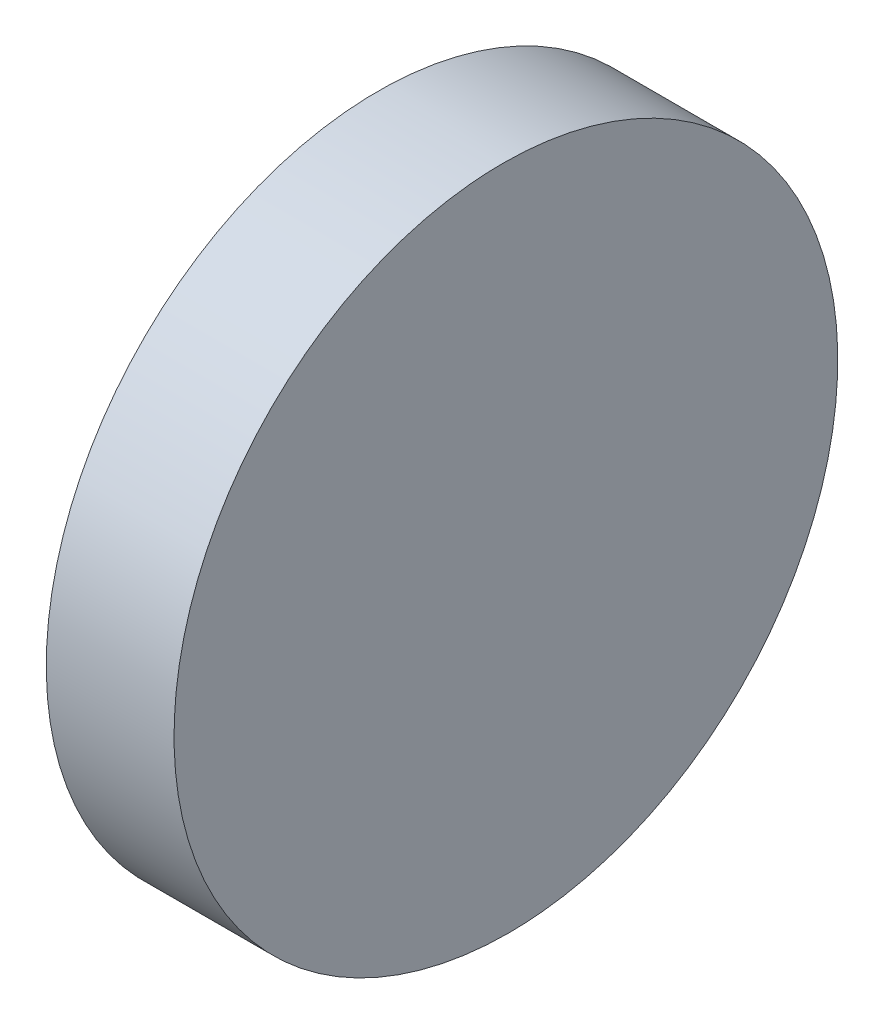
ISO-10303-21;
HEADER;
FILE_DESCRIPTION(('STEP AP214'),'2;1');
FILE_NAME('part.step','',(''),(''),'','','');
FILE_SCHEMA(('AUTOMOTIVE_DESIGN { 1 0 10303 214 1 1 1 1 }'));
ENDSEC;
DATA;
#1=APPLICATION_CONTEXT('core data for automotive mechanical design processes');
#2=APPLICATION_PROTOCOL_DEFINITION('international standard','automotive_design',2000,#1);
#3=PRODUCT_CONTEXT('',#1,'mechanical');
#4=PRODUCT('Part','Part','',(#3));
#5=PRODUCT_RELATED_PRODUCT_CATEGORY('part','',(#4));
#6=PRODUCT_DEFINITION_FORMATION('','',#4);
#7=PRODUCT_DEFINITION_CONTEXT('part definition',#1,'design');
#8=PRODUCT_DEFINITION('design','',#6,#7);
#9=PRODUCT_DEFINITION_SHAPE('','',#8);
#10=(LENGTH_UNIT() NAMED_UNIT(*) SI_UNIT(.MILLI.,.METRE.));
#11=(NAMED_UNIT(*) PLANE_ANGLE_UNIT() SI_UNIT($,.RADIAN.));
#12=(NAMED_UNIT(*) SI_UNIT($,.STERADIAN.) SOLID_ANGLE_UNIT());
#13=UNCERTAINTY_MEASURE_WITH_UNIT(LENGTH_MEASURE(1.E-05),#10,'distance_accuracy_value','');
#14=(GEOMETRIC_REPRESENTATION_CONTEXT(3) GLOBAL_UNCERTAINTY_ASSIGNED_CONTEXT((#13)) GLOBAL_UNIT_ASSIGNED_CONTEXT((#10,
#11,#12)) REPRESENTATION_CONTEXT('',''));
#15=CARTESIAN_POINT('',(0.,0.,0.));
#16=DIRECTION('',(0.,0.,1.));
#17=DIRECTION('',(1.,0.,0.));
#18=AXIS2_PLACEMENT_3D('',#15,#16,#17);
#19=CARTESIAN_POINT('',(0.,25.4,50.8));
#20=DIRECTION('',(1.,0.,0.));
#21=DIRECTION('',(0.,1.,0.));
#22=AXIS2_PLACEMENT_3D('',#19,#20,#21);
#23=PLANE('',#22);
#24=CARTESIAN_POINT('',(0.,0.,25.4));
#25=DIRECTION('',(-1.,0.,0.));
#26=DIRECTION('',(0.,-1.,0.));
#27=AXIS2_PLACEMENT_3D('',#24,#25,#26);
#28=CIRCLE('',#27,25.4);
#29=CARTESIAN_POINT('',(0.,-25.4,25.4));
#30=VERTEX_POINT('',#29);
#31=EDGE_CURVE('E117',#30,#30,#28,.T.);
#32=ORIENTED_EDGE('',*,*,#31,.T.);
#33=EDGE_LOOP('',(#32));
#34=FACE_BOUND('',#33,.T.);
#35=ADVANCED_FACE('F109',(#34),#23,.F.);
#36=CARTESIAN_POINT('',(10.,-25.4,50.8));
#37=DIRECTION('',(-0.999961923064172,-0.00872653549836697,0.));
#38=DIRECTION('',(0.00872653549836697,-0.999961923064171,0.));
#39=AXIS2_PLACEMENT_3D('',#36,#37,#38);
#40=PLANE('',#39);
#41=CARTESIAN_POINT('',(9.77833755811491,0.,25.4));
#42=DIRECTION('',(-0.999961923064172,-0.00872653549836697,0.));
#43=DIRECTION('',(-0.00872653549836697,0.999961923064171,0.));
#44=AXIS2_PLACEMENT_3D('',#41,#42,#43);
#45=ELLIPSE('',#44,25.4009671909977,25.4);
#46=CARTESIAN_POINT('',(9.55667511622982,25.4,25.4));
#47=VERTEX_POINT('',#46);
#48=EDGE_CURVE('E11',#47,#47,#45,.T.);
#49=ORIENTED_EDGE('',*,*,#48,.F.);
#50=EDGE_LOOP('',(#49));
#51=FACE_BOUND('',#50,.T.);
#52=ADVANCED_FACE('F111',(#51),#40,.F.);
#53=CARTESIAN_POINT('',(10.,0.,25.4));
#54=DIRECTION('',(-1.,0.,0.));
#55=DIRECTION('',(0.,-1.,0.));
#56=AXIS2_PLACEMENT_3D('',#53,#54,#55);
#57=CYLINDRICAL_SURFACE('',#56,25.4);
#58=ORIENTED_EDGE('',*,*,#31,.F.);
#59=EDGE_LOOP('',(#58));
#60=FACE_BOUND('',#59,.T.);
#61=ORIENTED_EDGE('',*,*,#48,.T.);
#62=EDGE_LOOP('',(#61));
#63=FACE_BOUND('',#62,.T.);
#64=ADVANCED_FACE('F125',(#60,#63),#57,.T.);
#65=CLOSED_SHELL('',(#35,#52,#64));
#66=MANIFOLD_SOLID_BREP('B2',#65);
#67=ADVANCED_BREP_SHAPE_REPRESENTATION('',(#18,#66),#14);
#68=SHAPE_DEFINITION_REPRESENTATION(#9,#67);
ENDSEC;
END-ISO-10303-21;
